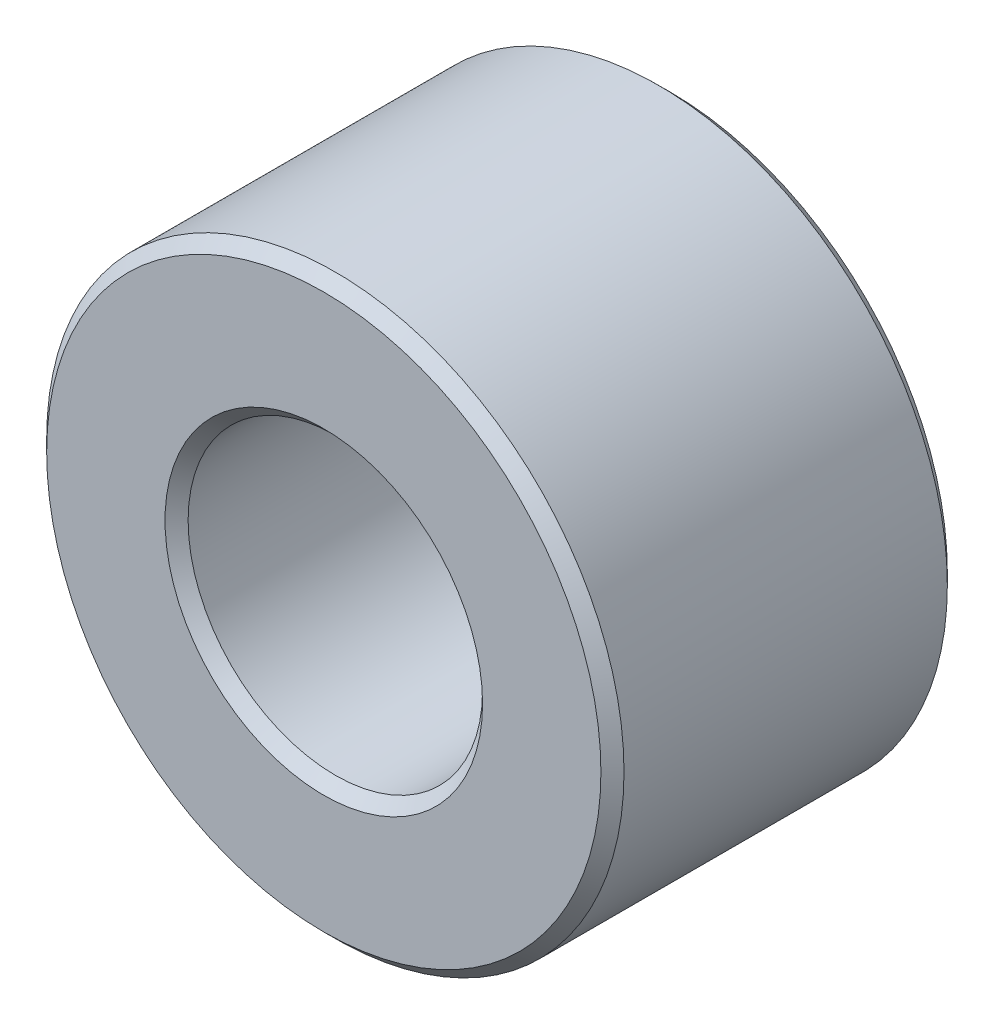
ISO-10303-21;
HEADER;
FILE_DESCRIPTION(('STEP AP214'),'2;1');
FILE_NAME('part.step','',(''),(''),'','','');
FILE_SCHEMA(('AUTOMOTIVE_DESIGN { 1 0 10303 214 1 1 1 1 }'));
ENDSEC;
DATA;
#1=APPLICATION_CONTEXT('core data for automotive mechanical design processes');
#2=APPLICATION_PROTOCOL_DEFINITION('international standard','automotive_design',2000,#1);
#3=PRODUCT_CONTEXT('',#1,'mechanical');
#4=PRODUCT('Part','Part','',(#3));
#5=PRODUCT_RELATED_PRODUCT_CATEGORY('part','',(#4));
#6=PRODUCT_DEFINITION_FORMATION('','',#4);
#7=PRODUCT_DEFINITION_CONTEXT('part definition',#1,'design');
#8=PRODUCT_DEFINITION('design','',#6,#7);
#9=PRODUCT_DEFINITION_SHAPE('','',#8);
#10=(LENGTH_UNIT() NAMED_UNIT(*) SI_UNIT(.MILLI.,.METRE.));
#11=(NAMED_UNIT(*) PLANE_ANGLE_UNIT() SI_UNIT($,.RADIAN.));
#12=(NAMED_UNIT(*) SI_UNIT($,.STERADIAN.) SOLID_ANGLE_UNIT());
#13=UNCERTAINTY_MEASURE_WITH_UNIT(LENGTH_MEASURE(1.E-05),#10,'distance_accuracy_value','');
#14=(GEOMETRIC_REPRESENTATION_CONTEXT(3) GLOBAL_UNCERTAINTY_ASSIGNED_CONTEXT((#13)) GLOBAL_UNIT_ASSIGNED_CONTEXT((#10,
#11,#12)) REPRESENTATION_CONTEXT('',''));
#15=CARTESIAN_POINT('',(0.,0.,0.));
#16=DIRECTION('',(0.,0.,1.));
#17=DIRECTION('',(1.,0.,0.));
#18=AXIS2_PLACEMENT_3D('',#15,#16,#17);
#19=CARTESIAN_POINT('',(0.,0.,6.));
#20=DIRECTION('',(0.,0.,1.));
#21=DIRECTION('',(1.,0.,0.));
#22=AXIS2_PLACEMENT_3D('',#19,#20,#21);
#23=PLANE('',#22);
#24=CARTESIAN_POINT('',(0.,0.,6.));
#25=DIRECTION('',(0.,0.,1.));
#26=DIRECTION('',(1.,0.,0.));
#27=AXIS2_PLACEMENT_3D('',#24,#25,#26);
#28=CIRCLE('',#27,2.75);
#29=CARTESIAN_POINT('',(2.75,0.,6.));
#30=VERTEX_POINT('',#29);
#31=EDGE_CURVE('E10',#30,#30,#28,.F.);
#32=ORIENTED_EDGE('',*,*,#31,.T.);
#33=EDGE_LOOP('',(#32));
#34=FACE_BOUND('',#33,.T.);
#35=CARTESIAN_POINT('',(0.,0.,6.));
#36=DIRECTION('',(0.,0.,1.));
#37=DIRECTION('',(1.,0.,0.));
#38=AXIS2_PLACEMENT_3D('',#35,#36,#37);
#39=CIRCLE('',#38,4.8);
#40=CARTESIAN_POINT('',(4.8,0.,6.));
#41=VERTEX_POINT('',#40);
#42=EDGE_CURVE('E43',#41,#41,#39,.T.);
#43=ORIENTED_EDGE('',*,*,#42,.T.);
#44=EDGE_LOOP('',(#43));
#45=FACE_BOUND('',#44,.T.);
#46=ADVANCED_FACE('F36',(#34,#45),#23,.T.);
#47=CARTESIAN_POINT('',(0.,0.,0.));
#48=DIRECTION('',(0.,0.,1.));
#49=DIRECTION('',(1.,0.,0.));
#50=AXIS2_PLACEMENT_3D('',#47,#48,#49);
#51=PLANE('',#50);
#52=CARTESIAN_POINT('',(0.,0.,0.));
#53=DIRECTION('',(0.,0.,1.));
#54=DIRECTION('',(1.,0.,0.));
#55=AXIS2_PLACEMENT_3D('',#52,#53,#54);
#56=CIRCLE('',#55,4.8);
#57=CARTESIAN_POINT('',(4.8,0.,0.));
#58=VERTEX_POINT('',#57);
#59=EDGE_CURVE('E56',#58,#58,#56,.F.);
#60=ORIENTED_EDGE('',*,*,#59,.T.);
#61=EDGE_LOOP('',(#60));
#62=FACE_BOUND('',#61,.T.);
#63=CARTESIAN_POINT('',(0.,0.,0.));
#64=DIRECTION('',(0.,0.,1.));
#65=DIRECTION('',(1.,0.,0.));
#66=AXIS2_PLACEMENT_3D('',#63,#64,#65);
#67=CIRCLE('',#66,2.75);
#68=CARTESIAN_POINT('',(2.75,0.,0.));
#69=VERTEX_POINT('',#68);
#70=EDGE_CURVE('E59',#69,#69,#67,.T.);
#71=ORIENTED_EDGE('',*,*,#70,.T.);
#72=EDGE_LOOP('',(#71));
#73=FACE_BOUND('',#72,.T.);
#74=ADVANCED_FACE('F80',(#62,#73),#51,.F.);
#75=CARTESIAN_POINT('',(0.,0.,6.));
#76=DIRECTION('',(0.,0.,-1.));
#77=DIRECTION('',(-1.,0.,0.));
#78=AXIS2_PLACEMENT_3D('',#75,#76,#77);
#79=CYLINDRICAL_SURFACE('',#78,5.);
#80=CARTESIAN_POINT('',(0.,0.,0.199999999999998));
#81=DIRECTION('',(0.,0.,1.));
#82=DIRECTION('',(1.,0.,0.));
#83=AXIS2_PLACEMENT_3D('',#80,#81,#82);
#84=CIRCLE('',#83,5.);
#85=CARTESIAN_POINT('',(5.,0.,0.199999999999998));
#86=VERTEX_POINT('',#85);
#87=EDGE_CURVE('E62',#86,#86,#84,.T.);
#88=ORIENTED_EDGE('',*,*,#87,.T.);
#89=EDGE_LOOP('',(#88));
#90=FACE_BOUND('',#89,.T.);
#91=CARTESIAN_POINT('',(0.,0.,5.8));
#92=DIRECTION('',(0.,0.,1.));
#93=DIRECTION('',(1.,0.,0.));
#94=AXIS2_PLACEMENT_3D('',#91,#92,#93);
#95=CIRCLE('',#94,5.);
#96=CARTESIAN_POINT('',(5.,0.,5.8));
#97=VERTEX_POINT('',#96);
#98=EDGE_CURVE('E65',#97,#97,#95,.F.);
#99=ORIENTED_EDGE('',*,*,#98,.T.);
#100=EDGE_LOOP('',(#99));
#101=FACE_BOUND('',#100,.T.);
#102=ADVANCED_FACE('F69',(#90,#101),#79,.T.);
#103=CARTESIAN_POINT('',(0.,0.,6.));
#104=DIRECTION('',(0.,0.,-1.));
#105=DIRECTION('',(-1.,0.,0.));
#106=AXIS2_PLACEMENT_3D('',#103,#104,#105);
#107=CYLINDRICAL_SURFACE('',#106,2.55);
#108=CARTESIAN_POINT('',(0.,0.,0.200000000000003));
#109=DIRECTION('',(0.,0.,1.));
#110=DIRECTION('',(1.,0.,0.));
#111=AXIS2_PLACEMENT_3D('',#108,#109,#110);
#112=CIRCLE('',#111,2.55);
#113=CARTESIAN_POINT('',(2.55,0.,0.200000000000003));
#114=VERTEX_POINT('',#113);
#115=EDGE_CURVE('E47',#114,#114,#112,.F.);
#116=ORIENTED_EDGE('',*,*,#115,.T.);
#117=EDGE_LOOP('',(#116));
#118=FACE_BOUND('',#117,.T.);
#119=CARTESIAN_POINT('',(0.,0.,5.8));
#120=DIRECTION('',(0.,0.,1.));
#121=DIRECTION('',(1.,0.,0.));
#122=AXIS2_PLACEMENT_3D('',#119,#120,#121);
#123=CIRCLE('',#122,2.55);
#124=CARTESIAN_POINT('',(2.55,0.,5.8));
#125=VERTEX_POINT('',#124);
#126=EDGE_CURVE('E51',#125,#125,#123,.T.);
#127=ORIENTED_EDGE('',*,*,#126,.T.);
#128=EDGE_LOOP('',(#127));
#129=FACE_BOUND('',#128,.T.);
#130=ADVANCED_FACE('F88',(#118,#129),#107,.F.);
#131=CARTESIAN_POINT('',(0.,0.,0.199999999999998));
#132=DIRECTION('',(0.,0.,1.));
#133=DIRECTION('',(1.,0.,0.));
#134=AXIS2_PLACEMENT_3D('',#131,#132,#133);
#135=CONICAL_SURFACE('',#134,5.,0.785398163397455);
#136=ORIENTED_EDGE('',*,*,#59,.F.);
#137=EDGE_LOOP('',(#136));
#138=FACE_BOUND('',#137,.T.);
#139=ORIENTED_EDGE('',*,*,#87,.F.);
#140=EDGE_LOOP('',(#139));
#141=FACE_BOUND('',#140,.T.);
#142=ADVANCED_FACE('F93',(#138,#141),#135,.T.);
#143=CARTESIAN_POINT('',(0.,0.,0.));
#144=DIRECTION('',(0.,0.,-1.));
#145=DIRECTION('',(-1.,0.,0.));
#146=AXIS2_PLACEMENT_3D('',#143,#144,#145);
#147=CONICAL_SURFACE('',#146,2.75,0.785398163397443);
#148=ORIENTED_EDGE('',*,*,#115,.F.);
#149=EDGE_LOOP('',(#148));
#150=FACE_BOUND('',#149,.T.);
#151=ORIENTED_EDGE('',*,*,#70,.F.);
#152=EDGE_LOOP('',(#151));
#153=FACE_BOUND('',#152,.T.);
#154=ADVANCED_FACE('F77',(#150,#153),#147,.F.);
#155=CARTESIAN_POINT('',(0.,0.,5.8));
#156=DIRECTION('',(0.,0.,1.));
#157=DIRECTION('',(1.,0.,0.));
#158=AXIS2_PLACEMENT_3D('',#155,#156,#157);
#159=CONICAL_SURFACE('',#158,2.55,0.785398163397454);
#160=ORIENTED_EDGE('',*,*,#31,.F.);
#161=EDGE_LOOP('',(#160));
#162=FACE_BOUND('',#161,.T.);
#163=ORIENTED_EDGE('',*,*,#126,.F.);
#164=EDGE_LOOP('',(#163));
#165=FACE_BOUND('',#164,.T.);
#166=ADVANCED_FACE('F73',(#162,#165),#159,.F.);
#167=CARTESIAN_POINT('',(0.,0.,6.));
#168=DIRECTION('',(0.,0.,-1.));
#169=DIRECTION('',(-1.,0.,0.));
#170=AXIS2_PLACEMENT_3D('',#167,#168,#169);
#171=CONICAL_SURFACE('',#170,4.8,0.785398163397448);
#172=ORIENTED_EDGE('',*,*,#98,.F.);
#173=EDGE_LOOP('',(#172));
#174=FACE_BOUND('',#173,.T.);
#175=ORIENTED_EDGE('',*,*,#42,.F.);
#176=EDGE_LOOP('',(#175));
#177=FACE_BOUND('',#176,.T.);
#178=ADVANCED_FACE('F38',(#174,#177),#171,.T.);
#179=CLOSED_SHELL('',(#46,#74,#102,#130,#142,#154,#166,#178));
#180=MANIFOLD_SOLID_BREP('B2',#179);
#181=ADVANCED_BREP_SHAPE_REPRESENTATION('',(#18,#180),#14);
#182=SHAPE_DEFINITION_REPRESENTATION(#9,#181);
ENDSEC;
END-ISO-10303-21;
